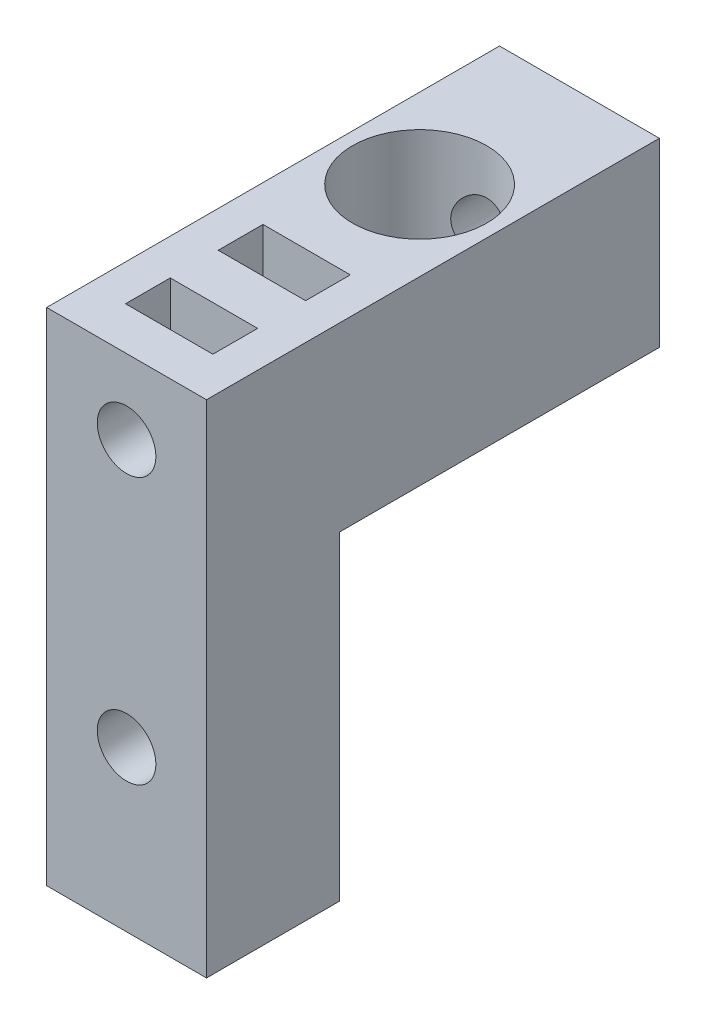
ISO-10303-21;
HEADER;
FILE_DESCRIPTION(('STEP AP214'),'2;1');
FILE_NAME('part.step','',(''),(''),'','','');
FILE_SCHEMA(('AUTOMOTIVE_DESIGN { 1 0 10303 214 1 1 1 1 }'));
ENDSEC;
DATA;
#1=APPLICATION_CONTEXT('core data for automotive mechanical design processes');
#2=APPLICATION_PROTOCOL_DEFINITION('international standard','automotive_design',2000,#1);
#3=PRODUCT_CONTEXT('',#1,'mechanical');
#4=PRODUCT('Part','Part','',(#3));
#5=PRODUCT_RELATED_PRODUCT_CATEGORY('part','',(#4));
#6=PRODUCT_DEFINITION_FORMATION('','',#4);
#7=PRODUCT_DEFINITION_CONTEXT('part definition',#1,'design');
#8=PRODUCT_DEFINITION('design','',#6,#7);
#9=PRODUCT_DEFINITION_SHAPE('','',#8);
#10=(LENGTH_UNIT() NAMED_UNIT(*) SI_UNIT(.MILLI.,.METRE.));
#11=(NAMED_UNIT(*) PLANE_ANGLE_UNIT() SI_UNIT($,.RADIAN.));
#12=(NAMED_UNIT(*) SI_UNIT($,.STERADIAN.) SOLID_ANGLE_UNIT());
#13=UNCERTAINTY_MEASURE_WITH_UNIT(LENGTH_MEASURE(1.E-05),#10,'distance_accuracy_value','');
#14=(GEOMETRIC_REPRESENTATION_CONTEXT(3) GLOBAL_UNCERTAINTY_ASSIGNED_CONTEXT((#13)) GLOBAL_UNIT_ASSIGNED_CONTEXT((#10,
#11,#12)) REPRESENTATION_CONTEXT('',''));
#15=CARTESIAN_POINT('',(0.,0.,0.));
#16=DIRECTION('',(0.,0.,1.));
#17=DIRECTION('',(1.,0.,0.));
#18=AXIS2_PLACEMENT_3D('',#15,#16,#17);
#19=CARTESIAN_POINT('',(7.49999999999999,40.,27.5));
#20=DIRECTION('',(0.,0.,1.));
#21=DIRECTION('',(1.,0.,0.));
#22=AXIS2_PLACEMENT_3D('',#19,#20,#21);
#23=CYLINDRICAL_SURFACE('',#22,2.75);
#24=CARTESIAN_POINT('',(7.49999999999999,40.,25.6));
#25=DIRECTION('',(0.,0.,-1.));
#26=DIRECTION('',(-1.,0.,0.));
#27=AXIS2_PLACEMENT_3D('',#24,#25,#26);
#28=CIRCLE('',#27,2.75);
#29=CARTESIAN_POINT('',(4.74999999999999,40.,25.6));
#30=VERTEX_POINT('',#29);
#31=EDGE_CURVE('E179',#30,#30,#28,.F.);
#32=ORIENTED_EDGE('',*,*,#31,.T.);
#33=EDGE_LOOP('',(#32));
#34=FACE_BOUND('',#33,.T.);
#35=CARTESIAN_POINT('',(10.25,40.,20.6681125606325));
#36=CARTESIAN_POINT('',(10.2499924092741,39.8540774734547,20.6681205914377));
#37=CARTESIAN_POINT('',(10.2383110862679,39.7079075681918,20.6738294748848));
#38=CARTESIAN_POINT('',(10.1920845273763,39.4198516847773,20.6959024175753));
#39=CARTESIAN_POINT('',(10.1574800833107,39.2779777977755,20.7122940675822));
#40=CARTESIAN_POINT('',(10.067041818049,39.003193725423,20.753497276925));
#41=CARTESIAN_POINT('',(10.0113002800261,38.8702474910219,20.7782721855899));
#42=CARTESIAN_POINT('',(9.880446217959,38.6156291641463,20.8333950607712));
#43=CARTESIAN_POINT('',(9.80533696738025,38.4939551711947,20.8637420852579));
#44=CARTESIAN_POINT('',(9.63238586559496,38.2569382393084,20.9289100748613));
#45=CARTESIAN_POINT('',(9.53342179265903,38.1424579705007,20.9638918505459));
#46=CARTESIAN_POINT('',(9.31792199343614,37.9310740175146,21.0330723919805));
#47=CARTESIAN_POINT('',(9.20137913150425,37.8341775063488,21.0672708332334));
#48=CARTESIAN_POINT('',(8.94710731987253,37.6561567340022,21.1330188734218));
#49=CARTESIAN_POINT('',(8.80862573704594,37.5760234329047,21.1643600149649));
#50=CARTESIAN_POINT('',(8.5185296896165,37.4405693338499,21.2188684684485));
#51=CARTESIAN_POINT('',(8.36692163772661,37.3852365007465,21.2420397438861));
#52=CARTESIAN_POINT('',(8.06395333486739,37.3041439628943,21.276453585584));
#53=CARTESIAN_POINT('',(7.91306227986627,37.2768910823722,21.2882957283285));
#54=CARTESIAN_POINT('',(7.6084161362641,37.2478865217807,21.3009083885346));
#55=CARTESIAN_POINT('',(7.45466236125199,37.2461234207963,21.3016838645095));
#56=CARTESIAN_POINT('',(7.1595923002128,37.2674112767957,21.2924139046718));
#57=CARTESIAN_POINT('',(7.01813025643118,37.288815622269,21.283086493591));
#58=CARTESIAN_POINT('',(6.74104167569439,37.3529807881936,21.2556672606275));
#59=CARTESIAN_POINT('',(6.60541557131005,37.3957431887927,21.2375747902762));
#60=CARTESIAN_POINT('',(6.34133571488901,37.5018872935531,21.1940049318835));
#61=CARTESIAN_POINT('',(6.21302334528026,37.5655742866435,21.1684188521874));
#62=CARTESIAN_POINT('',(5.96856922324547,37.7114415334946,21.1123213359339));
#63=CARTESIAN_POINT('',(5.85243190211498,37.793628486583,21.0818081162622));
#64=CARTESIAN_POINT('',(5.62620215559371,37.9814338489116,21.0161279529893));
#65=CARTESIAN_POINT('',(5.51724651768918,38.0883613576001,20.9807835687143));
#66=CARTESIAN_POINT('',(5.31829231676088,38.318970662723,20.9111154905237));
#67=CARTESIAN_POINT('',(5.22830254984559,38.4426601896484,20.8767922765227));
#68=CARTESIAN_POINT('',(5.06650243674171,38.7093274730662,20.8117128665262));
#69=CARTESIAN_POINT('',(4.99553811707991,38.8528693979138,20.7811480281723));
#70=CARTESIAN_POINT('',(4.87926350572341,39.1515500683865,20.729383736924));
#71=CARTESIAN_POINT('',(4.8339328059863,39.3066794769903,20.7081768367303));
#72=CARTESIAN_POINT('',(4.77325654817606,39.6127104707772,20.6794303504837));
#73=CARTESIAN_POINT('',(4.75605489993025,39.7631630769631,20.6710473574027));
#74=CARTESIAN_POINT('',(4.74662990613032,40.0650065515925,20.6664799588434));
#75=CARTESIAN_POINT('',(4.75439641169643,40.2163970138545,20.6702905969807));
#76=CARTESIAN_POINT('',(4.79298961447529,40.5041014649024,20.6888030951616));
#77=CARTESIAN_POINT('',(4.82208518673105,40.640707423998,20.7026865877575));
#78=CARTESIAN_POINT('',(4.90015626664933,40.9069568576824,20.7386972768413));
#79=CARTESIAN_POINT('',(4.94913673343745,41.0365985863114,20.7608265296392));
#80=CARTESIAN_POINT('',(5.06796541272098,41.2916553937274,20.8120181975855));
#81=CARTESIAN_POINT('',(5.1386394510746,41.4166311760435,20.8413435736169));
#82=CARTESIAN_POINT('',(5.29805383949075,41.6535857368343,20.9032820853337));
#83=CARTESIAN_POINT('',(5.38680250906331,41.7655584927887,20.9358967315235));
#84=CARTESIAN_POINT('',(5.58934637163347,41.9839466024392,21.0043170461837));
#85=CARTESIAN_POINT('',(5.70468573671718,42.0889293762635,21.0401430570787));
#86=CARTESIAN_POINT('',(5.9521325847544,42.2783508144024,21.1082369280155));
#87=CARTESIAN_POINT('',(6.08424207631589,42.3627870142532,21.1405043609693));
#88=CARTESIAN_POINT('',(6.36308633945311,42.5089548347466,21.1982098471011));
#89=CARTESIAN_POINT('',(6.50991260819576,42.570531585466,21.2236010121129));
#90=CARTESIAN_POINT('',(6.81324527279367,42.6676169958974,21.2643211768154));
#91=CARTESIAN_POINT('',(6.96974520892688,42.7031428518352,21.2796568134632));
#92=CARTESIAN_POINT('',(7.27524532002481,42.7448021315862,21.2977078038958));
#93=CARTESIAN_POINT('',(7.42392136001888,42.7529496100633,21.3012874708948));
#94=CARTESIAN_POINT('',(7.72049990840272,42.7451539268259,21.2978848235188));
#95=CARTESIAN_POINT('',(7.86840257066882,42.7292157557846,21.2909046971882));
#96=CARTESIAN_POINT('',(8.15284105500389,42.6751433905851,21.2676420107656));
#97=CARTESIAN_POINT('',(8.28959368509801,42.6379625521218,21.2517595279024));
#98=CARTESIAN_POINT('',(8.55483207368938,42.5435520550433,21.2125131595541));
#99=CARTESIAN_POINT('',(8.68331634064812,42.4863187910837,21.1891479287663));
#100=CARTESIAN_POINT('',(8.93487336709582,42.3505318591471,21.1358314486152));
#101=CARTESIAN_POINT('',(9.05742904742589,42.2711220350412,21.1056276443329));
#102=CARTESIAN_POINT('',(9.28801316394993,42.094426775915,21.0421300265961));
#103=CARTESIAN_POINT('',(9.39603560986121,41.9971340087925,21.0088349484841));
#104=CARTESIAN_POINT('',(9.60301020908649,41.7788101765852,20.9397087439667));
#105=CARTESIAN_POINT('',(9.70065664574947,41.656539631372,20.9038764431039));
#106=CARTESIAN_POINT('',(9.87433164575945,41.396243047281,20.8362037174457));
#107=CARTESIAN_POINT('',(9.95034720547711,41.2582076007382,20.8043657002585));
#108=CARTESIAN_POINT('',(10.0461818152758,41.0419747147908,20.7626528836381));
#109=CARTESIAN_POINT('',(10.0751167306867,40.9682821098437,20.7497452599118));
#110=CARTESIAN_POINT('',(10.1266134084659,40.8183358040734,20.7264040750814));
#111=CARTESIAN_POINT('',(10.1491783404764,40.7420833981927,20.7159692839362));
#112=CARTESIAN_POINT('',(10.1876196024708,40.5877992064951,20.6979953084316));
#113=CARTESIAN_POINT('',(10.2035135210967,40.5097726789338,20.6904485143467));
#114=CARTESIAN_POINT('',(10.2284836242757,40.3524378654559,20.6785183258838));
#115=CARTESIAN_POINT('',(10.2375649822422,40.2731305989738,20.6741325311632));
#116=CARTESIAN_POINT('',(10.2454521478687,40.1613541121056,20.6703172413374));
#117=CARTESIAN_POINT('',(10.247156649317,40.1291135328376,20.6694915431292));
#118=CARTESIAN_POINT('',(10.2494314276029,40.064586009651,20.6683883081248));
#119=CARTESIAN_POINT('',(10.250001680161,40.0322990647547,20.6681107830626));
#120=CARTESIAN_POINT('',(10.25,40.,20.6681125606325));
#121=B_SPLINE_CURVE_WITH_KNOTS('',3,(#35,#36,#37,#38,#39,#40,#41,#42,#43,#44,#45,#46,#47,#48,
#49,#50,#51,#52,#53,#54,#55,#56,#57,#58,#59,#60,#61,#62,#63,#64,#65,#66,#67,#68,#69,#70,#71,#72,
#73,#74,#75,#76,#77,#78,#79,#80,#81,#82,#83,#84,#85,#86,#87,#88,#89,#90,#91,#92,#93,#94,#95,#96,
#97,#98,#99,#100,#101,#102,#103,#104,#105,#106,#107,#108,#109,#110,#111,#112,#113,#114,#115,
#116,#117,#118,#119,#120),.UNSPECIFIED.,.T.,.F.,(4,2,2,2,2,2,2,2,2,2,2,2,2,2,2,2,2,2,2,2,2,2,2,
2,2,2,2,2,2,2,2,2,2,2,2,2,2,2,2,2,2,2,4),(0.,0.43763872831356,0.876412265274284,
1.31329179935423,1.75009754187145,2.21403476425211,2.67816081903767,3.16476159569473,
3.65112597886646,4.11003308212193,4.56873456172593,4.99685263975742,5.42500239623725,
5.85969893821755,6.29455314934977,6.76257660796078,7.2308166540192,7.71732093612508,
8.20343734366186,8.65595158211015,9.10828190900926,9.52747353914117,9.9467697764267,
10.3845776565105,10.8225875109826,11.3004496734107,11.7783691249115,12.2594697591699,
12.7402525317592,13.1847875746728,13.6292305202179,14.0551389328554,14.4811239614208,
14.9266121208039,15.3722833418068,15.8516931705818,16.3313905956837,16.5717618853012,
16.8120133568112,17.0516273459984,17.2910591891952,17.3879257895205,17.4847944633273),.UNSPECIFIED.);
#122=CARTESIAN_POINT('',(10.25,40.,20.6681125606325));
#123=VERTEX_POINT('',#122);
#124=EDGE_CURVE('E220',#123,#123,#121,.T.);
#125=ORIENTED_EDGE('',*,*,#124,.T.);
#126=EDGE_LOOP('',(#125));
#127=FACE_BOUND('',#126,.T.);
#128=ADVANCED_FACE('F34',(#34,#127),#23,.F.);
#129=CARTESIAN_POINT('',(7.49999999999999,40.,29.8));
#130=DIRECTION('',(0.,0.,1.));
#131=DIRECTION('',(1.,0.,0.));
#132=AXIS2_PLACEMENT_3D('',#129,#130,#131);
#133=CIRCLE('',#132,2.75);
#134=CARTESIAN_POINT('',(10.25,40.,29.8));
#135=VERTEX_POINT('',#134);
#136=EDGE_CURVE('E173',#135,#135,#133,.F.);
#137=ORIENTED_EDGE('',*,*,#136,.T.);
#138=EDGE_LOOP('',(#137));
#139=FACE_BOUND('',#138,.T.);
#140=CARTESIAN_POINT('',(7.49999999999999,40.,34.3));
#141=DIRECTION('',(0.,0.,-1.));
#142=DIRECTION('',(-1.,0.,0.));
#143=AXIS2_PLACEMENT_3D('',#140,#141,#142);
#144=CIRCLE('',#143,2.75);
#145=CARTESIAN_POINT('',(4.74999999999999,40.,34.3));
#146=VERTEX_POINT('',#145);
#147=EDGE_CURVE('E38',#146,#146,#144,.F.);
#148=ORIENTED_EDGE('',*,*,#147,.T.);
#149=EDGE_LOOP('',(#148));
#150=FACE_BOUND('',#149,.T.);
#151=ADVANCED_FACE('F258',(#139,#150),#23,.F.);
#152=CARTESIAN_POINT('',(0.,0.,42.5));
#153=DIRECTION('',(1.,0.,0.));
#154=DIRECTION('',(0.,1.,0.));
#155=AXIS2_PLACEMENT_3D('',#152,#153,#154);
#156=PLANE('',#155);
#157=DIRECTION('',(0.,-1.,0.));
#158=VECTOR('',#157,1.);
#159=CARTESIAN_POINT('',(0.,0.,0.));
#160=LINE('',#159,#158);
#161=CARTESIAN_POINT('',(0.,47.,0.));
#162=VERTEX_POINT('',#161);
#163=CARTESIAN_POINT('',(0.,30.,0.));
#164=VERTEX_POINT('',#163);
#165=EDGE_CURVE('E319',#162,#164,#160,.T.);
#166=ORIENTED_EDGE('',*,*,#165,.T.);
#167=DIRECTION('',(0.,0.,-1.));
#168=VECTOR('',#167,1.);
#169=CARTESIAN_POINT('',(0.,30.,0.));
#170=LINE('',#169,#168);
#171=CARTESIAN_POINT('',(0.,30.,30.));
#172=VERTEX_POINT('',#171);
#173=EDGE_CURVE('E308',#172,#164,#170,.T.);
#174=ORIENTED_EDGE('',*,*,#173,.F.);
#175=DIRECTION('',(0.,1.,0.));
#176=VECTOR('',#175,1.);
#177=CARTESIAN_POINT('',(0.,0.,30.));
#178=LINE('',#177,#176);
#179=CARTESIAN_POINT('',(0.,0.,30.));
#180=VERTEX_POINT('',#179);
#181=EDGE_CURVE('E312',#180,#172,#178,.T.);
#182=ORIENTED_EDGE('',*,*,#181,.F.);
#183=DIRECTION('',(0.,0.,-1.));
#184=VECTOR('',#183,1.);
#185=CARTESIAN_POINT('',(0.,0.,42.5));
#186=LINE('',#185,#184);
#187=CARTESIAN_POINT('',(0.,0.,42.5));
#188=VERTEX_POINT('',#187);
#189=EDGE_CURVE('E11',#188,#180,#186,.T.);
#190=ORIENTED_EDGE('',*,*,#189,.F.);
#191=DIRECTION('',(0.,-1.,0.));
#192=VECTOR('',#191,1.);
#193=CARTESIAN_POINT('',(0.,0.,42.5));
#194=LINE('',#193,#192);
#195=CARTESIAN_POINT('',(0.,47.,42.5));
#196=VERTEX_POINT('',#195);
#197=EDGE_CURVE('E323',#196,#188,#194,.T.);
#198=ORIENTED_EDGE('',*,*,#197,.F.);
#199=DIRECTION('',(0.,0.,-1.));
#200=VECTOR('',#199,1.);
#201=CARTESIAN_POINT('',(0.,47.,42.5));
#202=LINE('',#201,#200);
#203=EDGE_CURVE('E333',#196,#162,#202,.T.);
#204=ORIENTED_EDGE('',*,*,#203,.T.);
#205=EDGE_LOOP('',(#166,#174,#182,#190,#198,#204));
#206=FACE_BOUND('',#205,.T.);
#207=ADVANCED_FACE('F36',(#206),#156,.F.);
#208=CARTESIAN_POINT('',(0.,0.,42.5));
#209=DIRECTION('',(0.,1.,0.));
#210=DIRECTION('',(0.,0.,1.));
#211=AXIS2_PLACEMENT_3D('',#208,#209,#210);
#212=PLANE('',#211);
#213=ORIENTED_EDGE('',*,*,#189,.T.);
#214=DIRECTION('',(-1.,0.,0.));
#215=VECTOR('',#214,1.);
#216=CARTESIAN_POINT('',(15.,0.,30.));
#217=LINE('',#216,#215);
#218=CARTESIAN_POINT('',(15.,0.,30.));
#219=VERTEX_POINT('',#218);
#220=EDGE_CURVE('E311',#219,#180,#217,.T.);
#221=ORIENTED_EDGE('',*,*,#220,.F.);
#222=DIRECTION('',(0.,0.,-1.));
#223=VECTOR('',#222,1.);
#224=CARTESIAN_POINT('',(15.,0.,42.5));
#225=LINE('',#224,#223);
#226=CARTESIAN_POINT('',(15.,0.,42.5));
#227=VERTEX_POINT('',#226);
#228=EDGE_CURVE('E43',#227,#219,#225,.T.);
#229=ORIENTED_EDGE('',*,*,#228,.F.);
#230=DIRECTION('',(1.,0.,0.));
#231=VECTOR('',#230,1.);
#232=CARTESIAN_POINT('',(0.,0.,42.5));
#233=LINE('',#232,#231);
#234=EDGE_CURVE('E326',#188,#227,#233,.T.);
#235=ORIENTED_EDGE('',*,*,#234,.F.);
#236=EDGE_LOOP('',(#213,#221,#229,#235));
#237=FACE_BOUND('',#236,.T.);
#238=ADVANCED_FACE('F352',(#237),#212,.F.);
#239=CARTESIAN_POINT('',(15.,0.,42.5));
#240=DIRECTION('',(-1.,0.,0.));
#241=DIRECTION('',(0.,-1.,0.));
#242=AXIS2_PLACEMENT_3D('',#239,#240,#241);
#243=PLANE('',#242);
#244=DIRECTION('',(0.,1.,0.));
#245=VECTOR('',#244,1.);
#246=CARTESIAN_POINT('',(15.,0.,30.));
#247=LINE('',#246,#245);
#248=CARTESIAN_POINT('',(15.,30.,30.));
#249=VERTEX_POINT('',#248);
#250=EDGE_CURVE('E304',#219,#249,#247,.T.);
#251=ORIENTED_EDGE('',*,*,#250,.T.);
#252=DIRECTION('',(0.,0.,-1.));
#253=VECTOR('',#252,1.);
#254=CARTESIAN_POINT('',(15.,30.,0.));
#255=LINE('',#254,#253);
#256=CARTESIAN_POINT('',(15.,30.,0.));
#257=VERTEX_POINT('',#256);
#258=EDGE_CURVE('E307',#249,#257,#255,.T.);
#259=ORIENTED_EDGE('',*,*,#258,.T.);
#260=DIRECTION('',(0.,1.,0.));
#261=VECTOR('',#260,1.);
#262=CARTESIAN_POINT('',(15.,0.,0.));
#263=LINE('',#262,#261);
#264=CARTESIAN_POINT('',(15.,47.,0.));
#265=VERTEX_POINT('',#264);
#266=EDGE_CURVE('E336',#257,#265,#263,.T.);
#267=ORIENTED_EDGE('',*,*,#266,.T.);
#268=DIRECTION('',(0.,0.,-1.));
#269=VECTOR('',#268,1.);
#270=CARTESIAN_POINT('',(15.,47.,42.5));
#271=LINE('',#270,#269);
#272=CARTESIAN_POINT('',(15.,47.,42.5));
#273=VERTEX_POINT('',#272);
#274=EDGE_CURVE('E341',#273,#265,#271,.T.);
#275=ORIENTED_EDGE('',*,*,#274,.F.);
#276=DIRECTION('',(0.,1.,0.));
#277=VECTOR('',#276,1.);
#278=CARTESIAN_POINT('',(15.,0.,42.5));
#279=LINE('',#278,#277);
#280=EDGE_CURVE('E329',#227,#273,#279,.T.);
#281=ORIENTED_EDGE('',*,*,#280,.F.);
#282=ORIENTED_EDGE('',*,*,#228,.T.);
#283=EDGE_LOOP('',(#251,#259,#267,#275,#281,#282));
#284=FACE_BOUND('',#283,.T.);
#285=ADVANCED_FACE('F348',(#284),#243,.F.);
#286=CARTESIAN_POINT('',(0.,47.,42.5));
#287=DIRECTION('',(0.,-1.,0.));
#288=DIRECTION('',(0.,0.,-1.));
#289=AXIS2_PLACEMENT_3D('',#286,#287,#288);
#290=PLANE('',#289);
#291=DIRECTION('',(1.,0.,0.));
#292=VECTOR('',#291,1.);
#293=CARTESIAN_POINT('',(3.39999999999999,47.,29.8));
#294=LINE('',#293,#292);
#295=CARTESIAN_POINT('',(3.39999999999999,47.,29.8));
#296=VERTEX_POINT('',#295);
#297=CARTESIAN_POINT('',(11.6,47.,29.8));
#298=VERTEX_POINT('',#297);
#299=EDGE_CURVE('E167',#296,#298,#294,.T.);
#300=ORIENTED_EDGE('',*,*,#299,.F.);
#301=DIRECTION('',(0.,0.,1.));
#302=VECTOR('',#301,1.);
#303=CARTESIAN_POINT('',(3.39999999999999,47.,29.8));
#304=LINE('',#303,#302);
#305=CARTESIAN_POINT('',(3.39999999999999,47.,25.6));
#306=VERTEX_POINT('',#305);
#307=EDGE_CURVE('E51',#306,#296,#304,.T.);
#308=ORIENTED_EDGE('',*,*,#307,.F.);
#309=DIRECTION('',(-1.,0.,0.));
#310=VECTOR('',#309,1.);
#311=CARTESIAN_POINT('',(3.39999999999999,47.,25.6));
#312=LINE('',#311,#310);
#313=CARTESIAN_POINT('',(11.6,47.,25.6));
#314=VERTEX_POINT('',#313);
#315=EDGE_CURVE('E158',#314,#306,#312,.T.);
#316=ORIENTED_EDGE('',*,*,#315,.F.);
#317=DIRECTION('',(0.,0.,-1.));
#318=VECTOR('',#317,1.);
#319=CARTESIAN_POINT('',(11.6,47.,29.8));
#320=LINE('',#319,#318);
#321=EDGE_CURVE('E161',#298,#314,#320,.T.);
#322=ORIENTED_EDGE('',*,*,#321,.F.);
#323=EDGE_LOOP('',(#300,#308,#316,#322));
#324=FACE_BOUND('',#323,.T.);
#325=DIRECTION('',(1.,0.,0.));
#326=VECTOR('',#325,1.);
#327=CARTESIAN_POINT('',(3.39999999999999,47.,38.5));
#328=LINE('',#327,#326);
#329=CARTESIAN_POINT('',(3.39999999999999,47.,38.5));
#330=VERTEX_POINT('',#329);
#331=CARTESIAN_POINT('',(11.6,47.,38.5));
#332=VERTEX_POINT('',#331);
#333=EDGE_CURVE('E197',#330,#332,#328,.T.);
#334=ORIENTED_EDGE('',*,*,#333,.F.);
#335=DIRECTION('',(0.,0.,1.));
#336=VECTOR('',#335,1.);
#337=CARTESIAN_POINT('',(3.39999999999999,47.,38.5));
#338=LINE('',#337,#336);
#339=CARTESIAN_POINT('',(3.39999999999999,47.,34.3));
#340=VERTEX_POINT('',#339);
#341=EDGE_CURVE('E59',#340,#330,#338,.T.);
#342=ORIENTED_EDGE('',*,*,#341,.F.);
#343=DIRECTION('',(-1.,0.,0.));
#344=VECTOR('',#343,1.);
#345=CARTESIAN_POINT('',(3.39999999999999,47.,34.3));
#346=LINE('',#345,#344);
#347=CARTESIAN_POINT('',(11.6,47.,34.3));
#348=VERTEX_POINT('',#347);
#349=EDGE_CURVE('E186',#348,#340,#346,.T.);
#350=ORIENTED_EDGE('',*,*,#349,.F.);
#351=DIRECTION('',(0.,0.,-1.));
#352=VECTOR('',#351,1.);
#353=CARTESIAN_POINT('',(11.6,47.,38.5));
#354=LINE('',#353,#352);
#355=EDGE_CURVE('E200',#332,#348,#354,.T.);
#356=ORIENTED_EDGE('',*,*,#355,.F.);
#357=EDGE_LOOP('',(#334,#342,#350,#356));
#358=FACE_BOUND('',#357,.T.);
#359=CARTESIAN_POINT('',(7.49999999999999,47.,15.));
#360=DIRECTION('',(0.,-1.,0.));
#361=DIRECTION('',(0.,0.,-1.));
#362=AXIS2_PLACEMENT_3D('',#359,#360,#361);
#363=CIRCLE('',#362,6.3);
#364=CARTESIAN_POINT('',(7.49999999999999,47.,8.7));
#365=VERTEX_POINT('',#364);
#366=EDGE_CURVE('E227',#365,#365,#363,.T.);
#367=ORIENTED_EDGE('',*,*,#366,.T.);
#368=EDGE_LOOP('',(#367));
#369=FACE_BOUND('',#368,.T.);
#370=DIRECTION('',(-1.,0.,0.));
#371=VECTOR('',#370,1.);
#372=CARTESIAN_POINT('',(0.,47.,0.));
#373=LINE('',#372,#371);
#374=EDGE_CURVE('E327',#265,#162,#373,.T.);
#375=ORIENTED_EDGE('',*,*,#374,.T.);
#376=ORIENTED_EDGE('',*,*,#203,.F.);
#377=DIRECTION('',(-1.,0.,0.));
#378=VECTOR('',#377,1.);
#379=CARTESIAN_POINT('',(0.,47.,42.5));
#380=LINE('',#379,#378);
#381=EDGE_CURVE('E331',#273,#196,#380,.T.);
#382=ORIENTED_EDGE('',*,*,#381,.F.);
#383=ORIENTED_EDGE('',*,*,#274,.T.);
#384=EDGE_LOOP('',(#375,#376,#382,#383));
#385=FACE_BOUND('',#384,.T.);
#386=ADVANCED_FACE('F369',(#324,#358,#369,#385),#290,.F.);
#387=CARTESIAN_POINT('',(0.,0.,42.5));
#388=DIRECTION('',(0.,0.,-1.));
#389=DIRECTION('',(-1.,0.,0.));
#390=AXIS2_PLACEMENT_3D('',#387,#388,#389);
#391=PLANE('',#390);
#392=CARTESIAN_POINT('',(7.49999999999999,40.,42.5));
#393=DIRECTION('',(0.,0.,1.));
#394=DIRECTION('',(1.,0.,0.));
#395=AXIS2_PLACEMENT_3D('',#392,#393,#394);
#396=CIRCLE('',#395,2.75);
#397=CARTESIAN_POINT('',(10.25,40.,42.5));
#398=VERTEX_POINT('',#397);
#399=EDGE_CURVE('E295',#398,#398,#396,.T.);
#400=ORIENTED_EDGE('',*,*,#399,.F.);
#401=EDGE_LOOP('',(#400));
#402=FACE_BOUND('',#401,.T.);
#403=CARTESIAN_POINT('',(7.49999999999999,15.,42.5));
#404=DIRECTION('',(0.,0.,1.));
#405=DIRECTION('',(1.,0.,0.));
#406=AXIS2_PLACEMENT_3D('',#403,#404,#405);
#407=CIRCLE('',#406,2.75);
#408=CARTESIAN_POINT('',(10.25,15.,42.5));
#409=VERTEX_POINT('',#408);
#410=EDGE_CURVE('E297',#409,#409,#407,.T.);
#411=ORIENTED_EDGE('',*,*,#410,.F.);
#412=EDGE_LOOP('',(#411));
#413=FACE_BOUND('',#412,.T.);
#414=ORIENTED_EDGE('',*,*,#197,.T.);
#415=ORIENTED_EDGE('',*,*,#234,.T.);
#416=ORIENTED_EDGE('',*,*,#280,.T.);
#417=ORIENTED_EDGE('',*,*,#381,.T.);
#418=EDGE_LOOP('',(#414,#415,#416,#417));
#419=FACE_BOUND('',#418,.T.);
#420=ADVANCED_FACE('F372',(#402,#413,#419),#391,.F.);
#421=CARTESIAN_POINT('',(0.,0.,0.));
#422=DIRECTION('',(0.,0.,-1.));
#423=DIRECTION('',(-1.,0.,0.));
#424=AXIS2_PLACEMENT_3D('',#421,#422,#423);
#425=PLANE('',#424);
#426=CARTESIAN_POINT('',(7.49999999999999,40.,0.));
#427=DIRECTION('',(0.,0.,1.));
#428=DIRECTION('',(1.,0.,0.));
#429=AXIS2_PLACEMENT_3D('',#426,#427,#428);
#430=CIRCLE('',#429,2.75);
#431=CARTESIAN_POINT('',(10.25,40.,0.));
#432=VERTEX_POINT('',#431);
#433=EDGE_CURVE('E298',#432,#432,#430,.T.);
#434=ORIENTED_EDGE('',*,*,#433,.T.);
#435=EDGE_LOOP('',(#434));
#436=FACE_BOUND('',#435,.T.);
#437=DIRECTION('',(-1.,0.,0.));
#438=VECTOR('',#437,1.);
#439=CARTESIAN_POINT('',(15.,30.,0.));
#440=LINE('',#439,#438);
#441=EDGE_CURVE('E316',#257,#164,#440,.T.);
#442=ORIENTED_EDGE('',*,*,#441,.T.);
#443=ORIENTED_EDGE('',*,*,#165,.F.);
#444=ORIENTED_EDGE('',*,*,#374,.F.);
#445=ORIENTED_EDGE('',*,*,#266,.F.);
#446=EDGE_LOOP('',(#442,#443,#444,#445));
#447=FACE_BOUND('',#446,.T.);
#448=ADVANCED_FACE('F365',(#436,#447),#425,.T.);
#449=CARTESIAN_POINT('',(15.,30.,0.));
#450=DIRECTION('',(0.,1.,0.));
#451=DIRECTION('',(0.,0.,1.));
#452=AXIS2_PLACEMENT_3D('',#449,#450,#451);
#453=PLANE('',#452);
#454=CARTESIAN_POINT('',(7.49999999999999,30.,15.));
#455=DIRECTION('',(0.,1.,0.));
#456=DIRECTION('',(0.,0.,1.));
#457=AXIS2_PLACEMENT_3D('',#454,#455,#456);
#458=CIRCLE('',#457,3.29999999999999);
#459=CARTESIAN_POINT('',(7.49999999999999,30.,18.3));
#460=VERTEX_POINT('',#459);
#461=EDGE_CURVE('E219',#460,#460,#458,.T.);
#462=ORIENTED_EDGE('',*,*,#461,.T.);
#463=EDGE_LOOP('',(#462));
#464=FACE_BOUND('',#463,.T.);
#465=ORIENTED_EDGE('',*,*,#173,.T.);
#466=ORIENTED_EDGE('',*,*,#441,.F.);
#467=ORIENTED_EDGE('',*,*,#258,.F.);
#468=DIRECTION('',(-1.,0.,0.));
#469=VECTOR('',#468,1.);
#470=CARTESIAN_POINT('',(15.,30.,30.));
#471=LINE('',#470,#469);
#472=EDGE_CURVE('E320',#249,#172,#471,.T.);
#473=ORIENTED_EDGE('',*,*,#472,.T.);
#474=EDGE_LOOP('',(#465,#466,#467,#473));
#475=FACE_BOUND('',#474,.T.);
#476=ADVANCED_FACE('F361',(#464,#475),#453,.F.);
#477=CARTESIAN_POINT('',(15.,0.,30.));
#478=DIRECTION('',(0.,0.,1.));
#479=DIRECTION('',(0.,-1.,0.));
#480=AXIS2_PLACEMENT_3D('',#477,#478,#479);
#481=PLANE('',#480);
#482=CARTESIAN_POINT('',(7.49999999999999,15.,30.));
#483=DIRECTION('',(0.,0.,1.));
#484=DIRECTION('',(0.,-1.,0.));
#485=AXIS2_PLACEMENT_3D('',#482,#483,#484);
#486=CIRCLE('',#485,2.75);
#487=CARTESIAN_POINT('',(7.49999999999999,12.25,30.));
#488=VERTEX_POINT('',#487);
#489=EDGE_CURVE('E250',#488,#488,#486,.T.);
#490=ORIENTED_EDGE('',*,*,#489,.T.);
#491=EDGE_LOOP('',(#490));
#492=FACE_BOUND('',#491,.T.);
#493=ORIENTED_EDGE('',*,*,#181,.T.);
#494=ORIENTED_EDGE('',*,*,#472,.F.);
#495=ORIENTED_EDGE('',*,*,#250,.F.);
#496=ORIENTED_EDGE('',*,*,#220,.T.);
#497=EDGE_LOOP('',(#493,#494,#495,#496));
#498=FACE_BOUND('',#497,.T.);
#499=ADVANCED_FACE('F290',(#492,#498),#481,.F.);
#500=CARTESIAN_POINT('',(7.49999999999999,15.,27.5));
#501=DIRECTION('',(0.,0.,1.));
#502=DIRECTION('',(1.,0.,0.));
#503=AXIS2_PLACEMENT_3D('',#500,#501,#502);
#504=CYLINDRICAL_SURFACE('',#503,2.75);
#505=ORIENTED_EDGE('',*,*,#410,.T.);
#506=EDGE_LOOP('',(#505));
#507=FACE_BOUND('',#506,.T.);
#508=ORIENTED_EDGE('',*,*,#489,.F.);
#509=EDGE_LOOP('',(#508));
#510=FACE_BOUND('',#509,.T.);
#511=ADVANCED_FACE('F284',(#507,#510),#504,.F.);
#512=CARTESIAN_POINT('',(7.49999999999999,40.,38.5));
#513=DIRECTION('',(0.,0.,1.));
#514=DIRECTION('',(1.,0.,0.));
#515=AXIS2_PLACEMENT_3D('',#512,#513,#514);
#516=CIRCLE('',#515,2.75);
#517=CARTESIAN_POINT('',(10.25,40.,38.5));
#518=VERTEX_POINT('',#517);
#519=EDGE_CURVE('E207',#518,#518,#516,.F.);
#520=ORIENTED_EDGE('',*,*,#519,.T.);
#521=EDGE_LOOP('',(#520));
#522=FACE_BOUND('',#521,.T.);
#523=ORIENTED_EDGE('',*,*,#399,.T.);
#524=EDGE_LOOP('',(#523));
#525=FACE_BOUND('',#524,.T.);
#526=ADVANCED_FACE('F230',(#522,#525),#23,.F.);
#527=CARTESIAN_POINT('',(7.49999999999999,40.,0.));
#528=DIRECTION('',(0.,0.,1.));
#529=DIRECTION('',(1.,0.,0.));
#530=AXIS2_PLACEMENT_3D('',#527,#528,#529);
#531=CYLINDRICAL_SURFACE('',#530,2.75);
#532=CARTESIAN_POINT('',(10.25,40.,9.33188743936749));
#533=CARTESIAN_POINT('',(10.2499924092741,40.1459225265453,9.33187940856233));
#534=CARTESIAN_POINT('',(10.2383110862679,40.2920924318082,9.32617052511517));
#535=CARTESIAN_POINT('',(10.1920845273763,40.5801483152227,9.30409758242473));
#536=CARTESIAN_POINT('',(10.1574800833107,40.7220222022245,9.28770593241775));
#537=CARTESIAN_POINT('',(10.067041818049,40.996806274577,9.24650272307501));
#538=CARTESIAN_POINT('',(10.0113002800261,41.1297525089781,9.22172781441008));
#539=CARTESIAN_POINT('',(9.88044621795901,41.3843708358537,9.16660493922885));
#540=CARTESIAN_POINT('',(9.80533696738025,41.5060448288053,9.13625791474211));
#541=CARTESIAN_POINT('',(9.63238586559496,41.7430617606916,9.07108992513866));
#542=CARTESIAN_POINT('',(9.53342179265903,41.8575420294993,9.03610814945415));
#543=CARTESIAN_POINT('',(9.31792199343614,42.0689259824854,8.96692760801954));
#544=CARTESIAN_POINT('',(9.20137913150425,42.1658224936512,8.93272916676659));
#545=CARTESIAN_POINT('',(8.94710731987253,42.3438432659978,8.86698112657824));
#546=CARTESIAN_POINT('',(8.80862573704594,42.4239765670953,8.83563998503514));
#547=CARTESIAN_POINT('',(8.51852968961651,42.5594306661501,8.78113153155155));
#548=CARTESIAN_POINT('',(8.36692163772661,42.6147634992535,8.75796025611388));
#549=CARTESIAN_POINT('',(8.06395333486739,42.6958560371057,8.72354641441597));
#550=CARTESIAN_POINT('',(7.91306227986626,42.7231089176278,8.71170427167148));
#551=CARTESIAN_POINT('',(7.6084161362641,42.7521134782193,8.69909161146535));
#552=CARTESIAN_POINT('',(7.45466236125199,42.7538765792037,8.69831613549048));
#553=CARTESIAN_POINT('',(7.15959230021281,42.7325887232043,8.70758609532824));
#554=CARTESIAN_POINT('',(7.01813025643118,42.711184377731,8.71691350640895));
#555=CARTESIAN_POINT('',(6.74104167569439,42.6470192118064,8.7443327393725));
#556=CARTESIAN_POINT('',(6.60541557131006,42.6042568112073,8.7624252097238));
#557=CARTESIAN_POINT('',(6.34133571488901,42.4981127064469,8.80599506811651));
#558=CARTESIAN_POINT('',(6.21302334528026,42.4344257133565,8.83158114781263));
#559=CARTESIAN_POINT('',(5.96856922324547,42.2885584665054,8.88767866406613));
#560=CARTESIAN_POINT('',(5.85243190211498,42.206371513417,8.91819188373781));
#561=CARTESIAN_POINT('',(5.62620215559371,42.0185661510884,8.98387204701067));
#562=CARTESIAN_POINT('',(5.51724651768918,41.9116386423999,9.0192164312857));
#563=CARTESIAN_POINT('',(5.31829231676088,41.681029337277,9.08888450947634));
#564=CARTESIAN_POINT('',(5.22830254984559,41.5573398103516,9.12320772347733));
#565=CARTESIAN_POINT('',(5.06650243674171,41.2906725269338,9.18828713347384));
#566=CARTESIAN_POINT('',(4.99553811707991,41.1471306020862,9.21885197182769));
#567=CARTESIAN_POINT('',(4.87926350572341,40.8484499316135,9.27061626307599));
#568=CARTESIAN_POINT('',(4.8339328059863,40.6933205230097,9.29182316326968));
#569=CARTESIAN_POINT('',(4.77325654817606,40.3872895292228,9.32056964951629));
#570=CARTESIAN_POINT('',(4.75605489993025,40.2368369230369,9.32895264259733));
#571=CARTESIAN_POINT('',(4.74662990613032,39.9349934484075,9.33352004115657));
#572=CARTESIAN_POINT('',(4.75439641169643,39.7836029861455,9.32970940301925));
#573=CARTESIAN_POINT('',(4.79298961447529,39.4958985350976,9.31119690483843));
#574=CARTESIAN_POINT('',(4.82208518673105,39.359292576002,9.29731341224251));
#575=CARTESIAN_POINT('',(4.90015626664933,39.0930431423177,9.26130272315875));
#576=CARTESIAN_POINT('',(4.94913673343745,38.9634014136886,9.23917347036082));
#577=CARTESIAN_POINT('',(5.06796541272098,38.7083446062726,9.18798180241453));
#578=CARTESIAN_POINT('',(5.1386394510746,38.5833688239565,9.15865642638305));
#579=CARTESIAN_POINT('',(5.29805383949075,38.3464142631657,9.09671791466634));
#580=CARTESIAN_POINT('',(5.38680250906332,38.2344415072113,9.06410326847655));
#581=CARTESIAN_POINT('',(5.58934637163348,38.0160533975607,8.99568295381635));
#582=CARTESIAN_POINT('',(5.70468573671719,37.9110706237365,8.95985694292134));
#583=CARTESIAN_POINT('',(5.9521325847544,37.7216491855976,8.89176307198449));
#584=CARTESIAN_POINT('',(6.08424207631589,37.6372129857468,8.85949563903071));
#585=CARTESIAN_POINT('',(6.36308633945311,37.4910451652534,8.80179015289889));
#586=CARTESIAN_POINT('',(6.50991260819576,37.429468414534,8.77639898788708));
#587=CARTESIAN_POINT('',(6.81324527279367,37.3323830041026,8.73567882318459));
#588=CARTESIAN_POINT('',(6.96974520892688,37.2968571481648,8.72034318653684));
#589=CARTESIAN_POINT('',(7.27524532002481,37.2551978684138,8.70229219610419));
#590=CARTESIAN_POINT('',(7.42392136001888,37.2470503899367,8.69871252910519));
#591=CARTESIAN_POINT('',(7.72049990840272,37.2548460731741,8.70211517648118));
#592=CARTESIAN_POINT('',(7.86840257066882,37.2707842442154,8.70909530281182));
#593=CARTESIAN_POINT('',(8.15284105500389,37.3248566094149,8.73235798923444));
#594=CARTESIAN_POINT('',(8.28959368509801,37.3620374478782,8.74824047209755));
#595=CARTESIAN_POINT('',(8.55483207368938,37.4564479449567,8.78748684044587));
#596=CARTESIAN_POINT('',(8.68331634064812,37.5136812089163,8.81085207123369));
#597=CARTESIAN_POINT('',(8.93487336709582,37.6494681408529,8.86416855138481));
#598=CARTESIAN_POINT('',(9.05742904742588,37.7288779649588,8.89437235566715));
#599=CARTESIAN_POINT('',(9.28801316394993,37.905573224085,8.95786997340385));
#600=CARTESIAN_POINT('',(9.39603560986121,38.0028659912075,8.9911650515159));
#601=CARTESIAN_POINT('',(9.60301020908649,38.2211898234148,9.06029125603331));
#602=CARTESIAN_POINT('',(9.70065664574947,38.343460368628,9.09612355689613));
#603=CARTESIAN_POINT('',(9.87433164575945,38.603756952719,9.16379628255425));
#604=CARTESIAN_POINT('',(9.95034720547711,38.7417923992617,9.19563429974149));
#605=CARTESIAN_POINT('',(10.0461818152758,38.9580252852092,9.23734711636195));
#606=CARTESIAN_POINT('',(10.0751167306867,39.0317178901563,9.25025474008824));
#607=CARTESIAN_POINT('',(10.1266134084659,39.1816641959266,9.27359592491861));
#608=CARTESIAN_POINT('',(10.1491783404764,39.2579166018073,9.28403071606384));
#609=CARTESIAN_POINT('',(10.1876196024708,39.4122007935049,9.3020046915684));
#610=CARTESIAN_POINT('',(10.2035135210967,39.4902273210662,9.30955148565329));
#611=CARTESIAN_POINT('',(10.2284836242757,39.6475621345441,9.32148167411623));
#612=CARTESIAN_POINT('',(10.2375649822422,39.7268694010262,9.32586746883676));
#613=CARTESIAN_POINT('',(10.2454521478687,39.8386458878944,9.32968275866264));
#614=CARTESIAN_POINT('',(10.247156649317,39.8708864671624,9.33050845687075));
#615=CARTESIAN_POINT('',(10.2494314276029,39.935413990349,9.33161169187518));
#616=CARTESIAN_POINT('',(10.250001680161,39.9677009352453,9.33188921693743));
#617=CARTESIAN_POINT('',(10.25,40.,9.33188743936749));
#618=B_SPLINE_CURVE_WITH_KNOTS('',3,(#532,#533,#534,#535,#536,#537,#538,#539,#540,#541,#542,
#543,#544,#545,#546,#547,#548,#549,#550,#551,#552,#553,#554,#555,#556,#557,#558,#559,#560,#561,
#562,#563,#564,#565,#566,#567,#568,#569,#570,#571,#572,#573,#574,#575,#576,#577,#578,#579,#580,
#581,#582,#583,#584,#585,#586,#587,#588,#589,#590,#591,#592,#593,#594,#595,#596,#597,#598,#599,
#600,#601,#602,#603,#604,#605,#606,#607,#608,#609,#610,#611,#612,#613,#614,#615,#616,#617),
.UNSPECIFIED.,.T.,.F.,(4,2,2,2,2,2,2,2,2,2,2,2,2,2,2,2,2,2,2,2,2,2,2,2,2,2,2,2,2,2,2,2,2,2,2,2,
2,2,2,2,2,2,4),(0.,0.43763872831356,0.876412265274284,1.31329179935423,1.75009754187145,
2.21403476425211,2.67816081903767,3.16476159569473,3.65112597886646,4.11003308212193,
4.56873456172593,4.99685263975741,5.42500239623725,5.85969893821755,6.29455314934977,
6.76257660796077,7.2308166540192,7.71732093612508,8.20343734366186,8.65595158211016,
9.10828190900926,9.52747353914115,9.9467697764267,10.3845776565105,10.8225875109826,
11.3004496734107,11.7783691249115,12.2594697591699,12.7402525317592,13.1847875746728,
13.6292305202179,14.0551389328554,14.4811239614208,14.9266121208039,15.3722833418068,
15.8516931705818,16.3313905956837,16.5717618853012,16.8120133568112,17.0516273459984,
17.2910591891952,17.3879257895205,17.4847944633273),.UNSPECIFIED.);
#619=CARTESIAN_POINT('',(10.25,40.,9.33188743936749));
#620=VERTEX_POINT('',#619);
#621=EDGE_CURVE('E228',#620,#620,#618,.T.);
#622=ORIENTED_EDGE('',*,*,#621,.T.);
#623=EDGE_LOOP('',(#622));
#624=FACE_BOUND('',#623,.T.);
#625=ORIENTED_EDGE('',*,*,#433,.F.);
#626=EDGE_LOOP('',(#625));
#627=FACE_BOUND('',#626,.T.);
#628=ADVANCED_FACE('F239',(#624,#627),#531,.F.);
#629=CARTESIAN_POINT('',(7.49999999999999,52.2,15.));
#630=DIRECTION('',(0.,-1.,0.));
#631=DIRECTION('',(0.,0.,-1.));
#632=AXIS2_PLACEMENT_3D('',#629,#630,#631);
#633=CYLINDRICAL_SURFACE('',#632,6.3);
#634=ORIENTED_EDGE('',*,*,#124,.F.);
#635=EDGE_LOOP('',(#634));
#636=FACE_BOUND('',#635,.T.);
#637=CARTESIAN_POINT('',(7.49999999999999,37.2,15.));
#638=DIRECTION('',(0.,1.,0.));
#639=DIRECTION('',(0.,0.,1.));
#640=AXIS2_PLACEMENT_3D('',#637,#638,#639);
#641=CIRCLE('',#640,6.3);
#642=CARTESIAN_POINT('',(7.49999999999999,37.2,21.3));
#643=VERTEX_POINT('',#642);
#644=EDGE_CURVE('E213',#643,#643,#641,.T.);
#645=ORIENTED_EDGE('',*,*,#644,.F.);
#646=EDGE_LOOP('',(#645));
#647=FACE_BOUND('',#646,.T.);
#648=ORIENTED_EDGE('',*,*,#621,.F.);
#649=EDGE_LOOP('',(#648));
#650=FACE_BOUND('',#649,.T.);
#651=ORIENTED_EDGE('',*,*,#366,.F.);
#652=EDGE_LOOP('',(#651));
#653=FACE_BOUND('',#652,.T.);
#654=ADVANCED_FACE('F234',(#636,#647,#650,#653),#633,.F.);
#655=CARTESIAN_POINT('',(7.49999999999999,37.2,15.));
#656=DIRECTION('',(0.,1.,0.));
#657=DIRECTION('',(0.,0.,1.));
#658=AXIS2_PLACEMENT_3D('',#655,#656,#657);
#659=CYLINDRICAL_SURFACE('',#658,3.29999999999999);
#660=CARTESIAN_POINT('',(7.49999999999999,34.2,15.));
#661=DIRECTION('',(0.,1.,0.));
#662=DIRECTION('',(0.,0.,1.));
#663=AXIS2_PLACEMENT_3D('',#660,#661,#662);
#664=CIRCLE('',#663,3.3);
#665=CARTESIAN_POINT('',(7.49999999999999,34.2,18.3));
#666=VERTEX_POINT('',#665);
#667=EDGE_CURVE('E216',#666,#666,#664,.T.);
#668=ORIENTED_EDGE('',*,*,#667,.T.);
#669=EDGE_LOOP('',(#668));
#670=FACE_BOUND('',#669,.T.);
#671=ORIENTED_EDGE('',*,*,#461,.F.);
#672=EDGE_LOOP('',(#671));
#673=FACE_BOUND('',#672,.T.);
#674=ADVANCED_FACE('F238',(#670,#673),#659,.F.);
#675=CARTESIAN_POINT('',(7.49999999999999,37.2,15.));
#676=DIRECTION('',(0.,1.,0.));
#677=DIRECTION('',(0.,0.,1.));
#678=AXIS2_PLACEMENT_3D('',#675,#676,#677);
#679=CONICAL_SURFACE('',#678,6.3,0.785398163397448);
#680=ORIENTED_EDGE('',*,*,#667,.F.);
#681=EDGE_LOOP('',(#680));
#682=FACE_BOUND('',#681,.T.);
#683=ORIENTED_EDGE('',*,*,#644,.T.);
#684=EDGE_LOOP('',(#683));
#685=FACE_BOUND('',#684,.T.);
#686=ADVANCED_FACE('F263',(#682,#685),#679,.F.);
#687=CARTESIAN_POINT('',(3.39999999999999,35.,34.3));
#688=DIRECTION('',(0.,0.,-1.));
#689=DIRECTION('',(-1.,0.,0.));
#690=AXIS2_PLACEMENT_3D('',#687,#688,#689);
#691=PLANE('',#690);
#692=ORIENTED_EDGE('',*,*,#349,.T.);
#693=DIRECTION('',(0.,1.,0.));
#694=VECTOR('',#693,1.);
#695=CARTESIAN_POINT('',(3.39999999999999,35.,34.3));
#696=LINE('',#695,#694);
#697=CARTESIAN_POINT('',(3.39999999999999,35.,34.3));
#698=VERTEX_POINT('',#697);
#699=EDGE_CURVE('E205',#698,#340,#696,.T.);
#700=ORIENTED_EDGE('',*,*,#699,.F.);
#701=DIRECTION('',(-1.,0.,0.));
#702=VECTOR('',#701,1.);
#703=CARTESIAN_POINT('',(3.39999999999999,35.,34.3));
#704=LINE('',#703,#702);
#705=CARTESIAN_POINT('',(11.6,35.,34.3));
#706=VERTEX_POINT('',#705);
#707=EDGE_CURVE('E192',#706,#698,#704,.T.);
#708=ORIENTED_EDGE('',*,*,#707,.F.);
#709=DIRECTION('',(0.,1.,0.));
#710=VECTOR('',#709,1.);
#711=CARTESIAN_POINT('',(11.6,35.,34.3));
#712=LINE('',#711,#710);
#713=EDGE_CURVE('E208',#706,#348,#712,.T.);
#714=ORIENTED_EDGE('',*,*,#713,.T.);
#715=EDGE_LOOP('',(#692,#700,#708,#714));
#716=FACE_BOUND('',#715,.T.);
#717=ORIENTED_EDGE('',*,*,#147,.F.);
#718=EDGE_LOOP('',(#717));
#719=FACE_BOUND('',#718,.T.);
#720=ADVANCED_FACE('F260',(#716,#719),#691,.F.);
#721=CARTESIAN_POINT('',(3.39999999999999,35.,38.5));
#722=DIRECTION('',(0.,0.,1.));
#723=DIRECTION('',(1.,0.,0.));
#724=AXIS2_PLACEMENT_3D('',#721,#722,#723);
#725=PLANE('',#724);
#726=ORIENTED_EDGE('',*,*,#333,.T.);
#727=DIRECTION('',(0.,1.,0.));
#728=VECTOR('',#727,1.);
#729=CARTESIAN_POINT('',(11.6,35.,38.5));
#730=LINE('',#729,#728);
#731=CARTESIAN_POINT('',(11.6,35.,38.5));
#732=VERTEX_POINT('',#731);
#733=EDGE_CURVE('E210',#732,#332,#730,.T.);
#734=ORIENTED_EDGE('',*,*,#733,.F.);
#735=DIRECTION('',(1.,0.,0.));
#736=VECTOR('',#735,1.);
#737=CARTESIAN_POINT('',(3.39999999999999,35.,38.5));
#738=LINE('',#737,#736);
#739=CARTESIAN_POINT('',(3.39999999999999,35.,38.5));
#740=VERTEX_POINT('',#739);
#741=EDGE_CURVE('E185',#740,#732,#738,.T.);
#742=ORIENTED_EDGE('',*,*,#741,.F.);
#743=DIRECTION('',(0.,1.,0.));
#744=VECTOR('',#743,1.);
#745=CARTESIAN_POINT('',(3.39999999999999,35.,38.5));
#746=LINE('',#745,#744);
#747=EDGE_CURVE('E195',#740,#330,#746,.T.);
#748=ORIENTED_EDGE('',*,*,#747,.T.);
#749=EDGE_LOOP('',(#726,#734,#742,#748));
#750=FACE_BOUND('',#749,.T.);
#751=ORIENTED_EDGE('',*,*,#519,.F.);
#752=EDGE_LOOP('',(#751));
#753=FACE_BOUND('',#752,.T.);
#754=ADVANCED_FACE('F262',(#750,#753),#725,.F.);
#755=CARTESIAN_POINT('',(3.39999999999999,35.,38.5));
#756=DIRECTION('',(-1.,0.,0.));
#757=DIRECTION('',(0.,0.,1.));
#758=AXIS2_PLACEMENT_3D('',#755,#756,#757);
#759=PLANE('',#758);
#760=ORIENTED_EDGE('',*,*,#341,.T.);
#761=ORIENTED_EDGE('',*,*,#747,.F.);
#762=DIRECTION('',(0.,0.,1.));
#763=VECTOR('',#762,1.);
#764=CARTESIAN_POINT('',(3.39999999999999,35.,38.5));
#765=LINE('',#764,#763);
#766=EDGE_CURVE('E182',#698,#740,#765,.T.);
#767=ORIENTED_EDGE('',*,*,#766,.F.);
#768=ORIENTED_EDGE('',*,*,#699,.T.);
#769=EDGE_LOOP('',(#760,#761,#767,#768));
#770=FACE_BOUND('',#769,.T.);
#771=ADVANCED_FACE('F270',(#770),#759,.F.);
#772=CARTESIAN_POINT('',(11.6,35.,38.5));
#773=DIRECTION('',(1.,0.,0.));
#774=DIRECTION('',(0.,0.,-1.));
#775=AXIS2_PLACEMENT_3D('',#772,#773,#774);
#776=PLANE('',#775);
#777=ORIENTED_EDGE('',*,*,#355,.T.);
#778=ORIENTED_EDGE('',*,*,#713,.F.);
#779=DIRECTION('',(0.,0.,-1.));
#780=VECTOR('',#779,1.);
#781=CARTESIAN_POINT('',(11.6,35.,38.5));
#782=LINE('',#781,#780);
#783=EDGE_CURVE('E189',#732,#706,#782,.T.);
#784=ORIENTED_EDGE('',*,*,#783,.F.);
#785=ORIENTED_EDGE('',*,*,#733,.T.);
#786=EDGE_LOOP('',(#777,#778,#784,#785));
#787=FACE_BOUND('',#786,.T.);
#788=ADVANCED_FACE('F436',(#787),#776,.F.);
#789=CARTESIAN_POINT('',(0.,35.,0.));
#790=DIRECTION('',(0.,-1.,0.));
#791=DIRECTION('',(0.,0.,-1.));
#792=AXIS2_PLACEMENT_3D('',#789,#790,#791);
#793=PLANE('',#792);
#794=ORIENTED_EDGE('',*,*,#766,.T.);
#795=ORIENTED_EDGE('',*,*,#741,.T.);
#796=ORIENTED_EDGE('',*,*,#783,.T.);
#797=ORIENTED_EDGE('',*,*,#707,.T.);
#798=EDGE_LOOP('',(#794,#795,#796,#797));
#799=FACE_BOUND('',#798,.T.);
#800=ADVANCED_FACE('F445',(#799),#793,.F.);
#801=CARTESIAN_POINT('',(3.39999999999999,35.,25.6));
#802=DIRECTION('',(0.,0.,-1.));
#803=DIRECTION('',(-1.,0.,0.));
#804=AXIS2_PLACEMENT_3D('',#801,#802,#803);
#805=PLANE('',#804);
#806=ORIENTED_EDGE('',*,*,#315,.T.);
#807=DIRECTION('',(0.,1.,0.));
#808=VECTOR('',#807,1.);
#809=CARTESIAN_POINT('',(3.39999999999999,35.,25.6));
#810=LINE('',#809,#808);
#811=CARTESIAN_POINT('',(3.39999999999999,35.,25.6));
#812=VERTEX_POINT('',#811);
#813=EDGE_CURVE('E171',#812,#306,#810,.T.);
#814=ORIENTED_EDGE('',*,*,#813,.F.);
#815=DIRECTION('',(-1.,0.,0.));
#816=VECTOR('',#815,1.);
#817=CARTESIAN_POINT('',(3.39999999999999,35.,25.6));
#818=LINE('',#817,#816);
#819=CARTESIAN_POINT('',(11.6,35.,25.6));
#820=VERTEX_POINT('',#819);
#821=EDGE_CURVE('E145',#820,#812,#818,.T.);
#822=ORIENTED_EDGE('',*,*,#821,.F.);
#823=DIRECTION('',(0.,1.,0.));
#824=VECTOR('',#823,1.);
#825=CARTESIAN_POINT('',(11.6,35.,25.6));
#826=LINE('',#825,#824);
#827=EDGE_CURVE('E174',#820,#314,#826,.T.);
#828=ORIENTED_EDGE('',*,*,#827,.T.);
#829=EDGE_LOOP('',(#806,#814,#822,#828));
#830=FACE_BOUND('',#829,.T.);
#831=ORIENTED_EDGE('',*,*,#31,.F.);
#832=EDGE_LOOP('',(#831));
#833=FACE_BOUND('',#832,.T.);
#834=ADVANCED_FACE('F454',(#830,#833),#805,.F.);
#835=CARTESIAN_POINT('',(3.39999999999999,35.,29.8));
#836=DIRECTION('',(0.,0.,1.));
#837=DIRECTION('',(1.,0.,0.));
#838=AXIS2_PLACEMENT_3D('',#835,#836,#837);
#839=PLANE('',#838);
#840=ORIENTED_EDGE('',*,*,#299,.T.);
#841=DIRECTION('',(0.,1.,0.));
#842=VECTOR('',#841,1.);
#843=CARTESIAN_POINT('',(11.6,35.,29.8));
#844=LINE('',#843,#842);
#845=CARTESIAN_POINT('',(11.6,35.,29.8));
#846=VERTEX_POINT('',#845);
#847=EDGE_CURVE('E144',#846,#298,#844,.T.);
#848=ORIENTED_EDGE('',*,*,#847,.F.);
#849=DIRECTION('',(1.,0.,0.));
#850=VECTOR('',#849,1.);
#851=CARTESIAN_POINT('',(3.39999999999999,35.,29.8));
#852=LINE('',#851,#850);
#853=CARTESIAN_POINT('',(3.39999999999999,35.,29.8));
#854=VERTEX_POINT('',#853);
#855=EDGE_CURVE('E148',#854,#846,#852,.T.);
#856=ORIENTED_EDGE('',*,*,#855,.F.);
#857=DIRECTION('',(0.,1.,0.));
#858=VECTOR('',#857,1.);
#859=CARTESIAN_POINT('',(3.39999999999999,35.,29.8));
#860=LINE('',#859,#858);
#861=EDGE_CURVE('E135',#854,#296,#860,.T.);
#862=ORIENTED_EDGE('',*,*,#861,.T.);
#863=EDGE_LOOP('',(#840,#848,#856,#862));
#864=FACE_BOUND('',#863,.T.);
#865=ORIENTED_EDGE('',*,*,#136,.F.);
#866=EDGE_LOOP('',(#865));
#867=FACE_BOUND('',#866,.T.);
#868=ADVANCED_FACE('F149',(#864,#867),#839,.F.);
#869=CARTESIAN_POINT('',(3.39999999999999,35.,29.8));
#870=DIRECTION('',(-1.,0.,0.));
#871=DIRECTION('',(0.,0.,1.));
#872=AXIS2_PLACEMENT_3D('',#869,#870,#871);
#873=PLANE('',#872);
#874=ORIENTED_EDGE('',*,*,#307,.T.);
#875=ORIENTED_EDGE('',*,*,#861,.F.);
#876=DIRECTION('',(0.,0.,1.));
#877=VECTOR('',#876,1.);
#878=CARTESIAN_POINT('',(3.39999999999999,35.,29.8));
#879=LINE('',#878,#877);
#880=EDGE_CURVE('E139',#812,#854,#879,.T.);
#881=ORIENTED_EDGE('',*,*,#880,.F.);
#882=ORIENTED_EDGE('',*,*,#813,.T.);
#883=EDGE_LOOP('',(#874,#875,#881,#882));
#884=FACE_BOUND('',#883,.T.);
#885=ADVANCED_FACE('F137',(#884),#873,.F.);
#886=CARTESIAN_POINT('',(11.6,35.,29.8));
#887=DIRECTION('',(1.,0.,0.));
#888=DIRECTION('',(0.,0.,-1.));
#889=AXIS2_PLACEMENT_3D('',#886,#887,#888);
#890=PLANE('',#889);
#891=ORIENTED_EDGE('',*,*,#321,.T.);
#892=ORIENTED_EDGE('',*,*,#827,.F.);
#893=DIRECTION('',(0.,0.,-1.));
#894=VECTOR('',#893,1.);
#895=CARTESIAN_POINT('',(11.6,35.,29.8));
#896=LINE('',#895,#894);
#897=EDGE_CURVE('E154',#846,#820,#896,.T.);
#898=ORIENTED_EDGE('',*,*,#897,.F.);
#899=ORIENTED_EDGE('',*,*,#847,.T.);
#900=EDGE_LOOP('',(#891,#892,#898,#899));
#901=FACE_BOUND('',#900,.T.);
#902=ADVANCED_FACE('F480',(#901),#890,.F.);
#903=CARTESIAN_POINT('',(0.,35.,0.));
#904=DIRECTION('',(0.,-1.,0.));
#905=DIRECTION('',(0.,0.,-1.));
#906=AXIS2_PLACEMENT_3D('',#903,#904,#905);
#907=PLANE('',#906);
#908=ORIENTED_EDGE('',*,*,#880,.T.);
#909=ORIENTED_EDGE('',*,*,#855,.T.);
#910=ORIENTED_EDGE('',*,*,#897,.T.);
#911=ORIENTED_EDGE('',*,*,#821,.T.);
#912=EDGE_LOOP('',(#908,#909,#910,#911));
#913=FACE_BOUND('',#912,.T.);
#914=ADVANCED_FACE('F156',(#913),#907,.F.);
#915=CLOSED_SHELL('',(#128,#151,#207,#238,#285,#386,#420,#448,#476,#499,#511,#526,#628,#654,
#674,#686,#720,#754,#771,#788,#800,#834,#868,#885,#902,#914));
#916=MANIFOLD_SOLID_BREP('B2',#915);
#917=ADVANCED_BREP_SHAPE_REPRESENTATION('',(#18,#916),#14);
#918=SHAPE_DEFINITION_REPRESENTATION(#9,#917);
ENDSEC;
END-ISO-10303-21;
